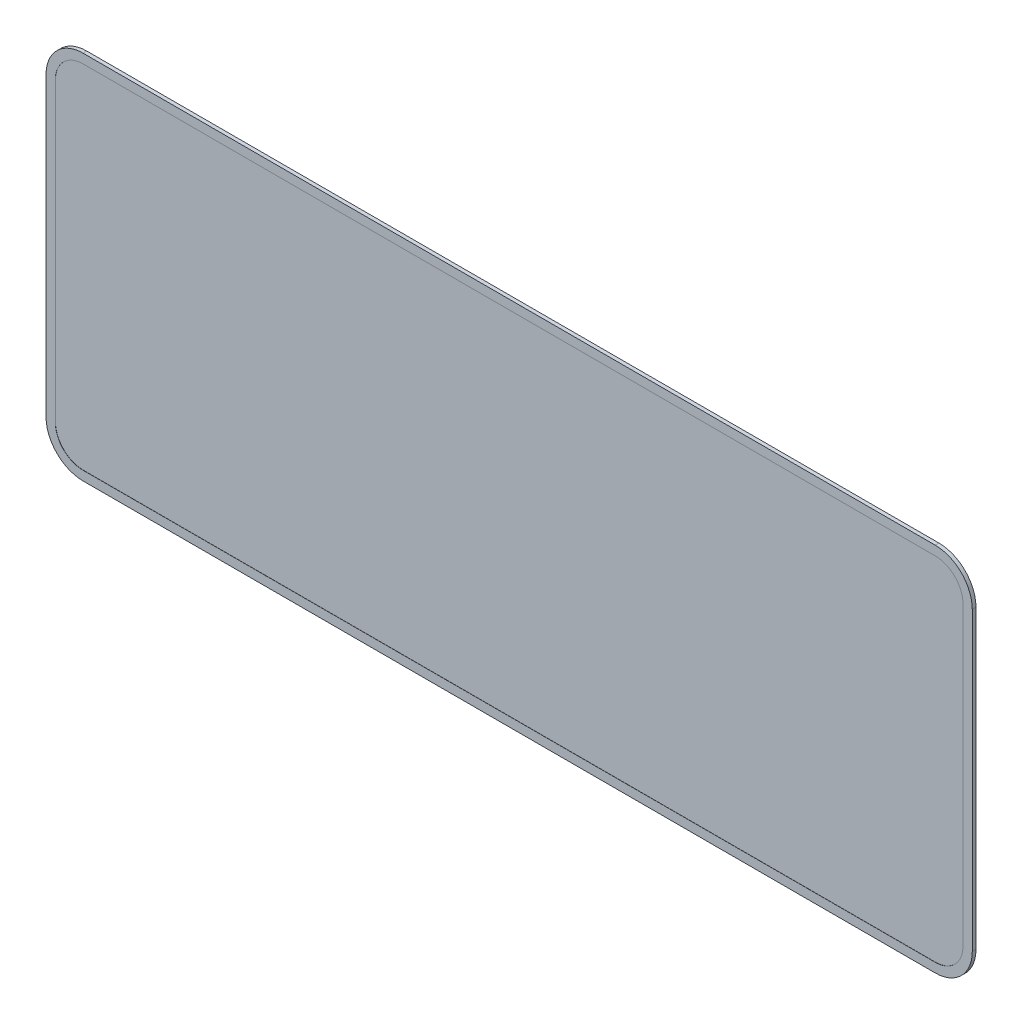
ISO-10303-21;
HEADER;
FILE_DESCRIPTION(('STEP AP214'),'2;1');
FILE_NAME('part.step','',(''),(''),'','','');
FILE_SCHEMA(('AUTOMOTIVE_DESIGN { 1 0 10303 214 1 1 1 1 }'));
ENDSEC;
DATA;
#1=APPLICATION_CONTEXT('core data for automotive mechanical design processes');
#2=APPLICATION_PROTOCOL_DEFINITION('international standard','automotive_design',2000,#1);
#3=PRODUCT_CONTEXT('',#1,'mechanical');
#4=PRODUCT('Part','Part','',(#3));
#5=PRODUCT_RELATED_PRODUCT_CATEGORY('part','',(#4));
#6=PRODUCT_DEFINITION_FORMATION('','',#4);
#7=PRODUCT_DEFINITION_CONTEXT('part definition',#1,'design');
#8=PRODUCT_DEFINITION('design','',#6,#7);
#9=PRODUCT_DEFINITION_SHAPE('','',#8);
#10=(LENGTH_UNIT() NAMED_UNIT(*) SI_UNIT(.MILLI.,.METRE.));
#11=(NAMED_UNIT(*) PLANE_ANGLE_UNIT() SI_UNIT($,.RADIAN.));
#12=(NAMED_UNIT(*) SI_UNIT($,.STERADIAN.) SOLID_ANGLE_UNIT());
#13=UNCERTAINTY_MEASURE_WITH_UNIT(LENGTH_MEASURE(1.E-05),#10,'distance_accuracy_value','');
#14=(GEOMETRIC_REPRESENTATION_CONTEXT(3) GLOBAL_UNCERTAINTY_ASSIGNED_CONTEXT((#13)) GLOBAL_UNIT_ASSIGNED_CONTEXT((#10,
#11,#12)) REPRESENTATION_CONTEXT('',''));
#15=CARTESIAN_POINT('',(0.,0.,0.));
#16=DIRECTION('',(0.,0.,1.));
#17=DIRECTION('',(1.,0.,0.));
#18=AXIS2_PLACEMENT_3D('',#15,#16,#17);
#19=CARTESIAN_POINT('',(480.,20.,2.));
#20=DIRECTION('',(0.,0.,-1.));
#21=DIRECTION('',(-1.,0.,0.));
#22=AXIS2_PLACEMENT_3D('',#19,#20,#21);
#23=CYLINDRICAL_SURFACE('',#22,20.);
#24=CARTESIAN_POINT('',(480.,20.,0.));
#25=DIRECTION('',(0.,0.,1.));
#26=DIRECTION('',(1.,0.,0.));
#27=AXIS2_PLACEMENT_3D('',#24,#25,#26);
#28=CIRCLE('',#27,20.);
#29=CARTESIAN_POINT('',(480.,0.,0.));
#30=VERTEX_POINT('',#29);
#31=CARTESIAN_POINT('',(500.,20.0000000000001,0.));
#32=VERTEX_POINT('',#31);
#33=EDGE_CURVE('E143',#30,#32,#28,.T.);
#34=ORIENTED_EDGE('',*,*,#33,.T.);
#35=DIRECTION('',(0.,0.,-1.));
#36=VECTOR('',#35,1.);
#37=CARTESIAN_POINT('',(500.,20.0000000000001,2.));
#38=LINE('',#37,#36);
#39=CARTESIAN_POINT('',(500.,20.0000000000001,2.));
#40=VERTEX_POINT('',#39);
#41=EDGE_CURVE('E11',#40,#32,#38,.T.);
#42=ORIENTED_EDGE('',*,*,#41,.F.);
#43=CARTESIAN_POINT('',(480.,20.,2.));
#44=DIRECTION('',(0.,0.,1.));
#45=DIRECTION('',(1.,0.,0.));
#46=AXIS2_PLACEMENT_3D('',#43,#44,#45);
#47=CIRCLE('',#46,20.);
#48=CARTESIAN_POINT('',(480.,0.,2.));
#49=VERTEX_POINT('',#48);
#50=EDGE_CURVE('E159',#49,#40,#47,.T.);
#51=ORIENTED_EDGE('',*,*,#50,.F.);
#52=DIRECTION('',(0.,0.,-1.));
#53=VECTOR('',#52,1.);
#54=CARTESIAN_POINT('',(480.,0.,2.));
#55=LINE('',#54,#53);
#56=EDGE_CURVE('E139',#49,#30,#55,.T.);
#57=ORIENTED_EDGE('',*,*,#56,.T.);
#58=EDGE_LOOP('',(#34,#42,#51,#57));
#59=FACE_BOUND('',#58,.T.);
#60=ADVANCED_FACE('F35',(#59),#23,.T.);
#61=CARTESIAN_POINT('',(500.,20.0000000000001,2.));
#62=DIRECTION('',(-1.,0.,0.));
#63=DIRECTION('',(0.,0.,1.));
#64=AXIS2_PLACEMENT_3D('',#61,#62,#63);
#65=PLANE('',#64);
#66=DIRECTION('',(0.,1.,0.));
#67=VECTOR('',#66,1.);
#68=CARTESIAN_POINT('',(500.,20.0000000000001,0.));
#69=LINE('',#68,#67);
#70=CARTESIAN_POINT('',(500.,180.,0.));
#71=VERTEX_POINT('',#70);
#72=EDGE_CURVE('E146',#32,#71,#69,.T.);
#73=ORIENTED_EDGE('',*,*,#72,.T.);
#74=DIRECTION('',(0.,0.,-1.));
#75=VECTOR('',#74,1.);
#76=CARTESIAN_POINT('',(500.,180.,2.));
#77=LINE('',#76,#75);
#78=CARTESIAN_POINT('',(500.,180.,2.));
#79=VERTEX_POINT('',#78);
#80=EDGE_CURVE('E42',#79,#71,#77,.T.);
#81=ORIENTED_EDGE('',*,*,#80,.F.);
#82=DIRECTION('',(0.,1.,0.));
#83=VECTOR('',#82,1.);
#84=CARTESIAN_POINT('',(500.,20.0000000000001,2.));
#85=LINE('',#84,#83);
#86=EDGE_CURVE('E99',#40,#79,#85,.T.);
#87=ORIENTED_EDGE('',*,*,#86,.F.);
#88=ORIENTED_EDGE('',*,*,#41,.T.);
#89=EDGE_LOOP('',(#73,#81,#87,#88));
#90=FACE_BOUND('',#89,.T.);
#91=ADVANCED_FACE('F333',(#90),#65,.F.);
#92=CARTESIAN_POINT('',(480.,180.,2.));
#93=DIRECTION('',(0.,0.,-1.));
#94=DIRECTION('',(-1.,0.,0.));
#95=AXIS2_PLACEMENT_3D('',#92,#93,#94);
#96=CYLINDRICAL_SURFACE('',#95,20.);
#97=CARTESIAN_POINT('',(480.,180.,0.));
#98=DIRECTION('',(0.,0.,1.));
#99=DIRECTION('',(-1.,0.,0.));
#100=AXIS2_PLACEMENT_3D('',#97,#98,#99);
#101=CIRCLE('',#100,20.);
#102=CARTESIAN_POINT('',(480.,200.,0.));
#103=VERTEX_POINT('',#102);
#104=EDGE_CURVE('E149',#71,#103,#101,.T.);
#105=ORIENTED_EDGE('',*,*,#104,.T.);
#106=DIRECTION('',(0.,0.,-1.));
#107=VECTOR('',#106,1.);
#108=CARTESIAN_POINT('',(480.,200.,2.));
#109=LINE('',#108,#107);
#110=CARTESIAN_POINT('',(480.,200.,2.));
#111=VERTEX_POINT('',#110);
#112=EDGE_CURVE('E166',#111,#103,#109,.T.);
#113=ORIENTED_EDGE('',*,*,#112,.F.);
#114=CARTESIAN_POINT('',(480.,180.,2.));
#115=DIRECTION('',(0.,0.,1.));
#116=DIRECTION('',(-1.,0.,0.));
#117=AXIS2_PLACEMENT_3D('',#114,#115,#116);
#118=CIRCLE('',#117,20.);
#119=EDGE_CURVE('E174',#79,#111,#118,.T.);
#120=ORIENTED_EDGE('',*,*,#119,.F.);
#121=ORIENTED_EDGE('',*,*,#80,.T.);
#122=EDGE_LOOP('',(#105,#113,#120,#121));
#123=FACE_BOUND('',#122,.T.);
#124=ADVANCED_FACE('F172',(#123),#96,.T.);
#125=CARTESIAN_POINT('',(20.0000000000001,200.,2.));
#126=DIRECTION('',(0.,-1.,0.));
#127=DIRECTION('',(0.,0.,-1.));
#128=AXIS2_PLACEMENT_3D('',#125,#126,#127);
#129=PLANE('',#128);
#130=DIRECTION('',(-1.,0.,0.));
#131=VECTOR('',#130,1.);
#132=CARTESIAN_POINT('',(20.0000000000001,200.,0.));
#133=LINE('',#132,#131);
#134=CARTESIAN_POINT('',(20.0000000000001,200.,0.));
#135=VERTEX_POINT('',#134);
#136=EDGE_CURVE('E151',#103,#135,#133,.T.);
#137=ORIENTED_EDGE('',*,*,#136,.T.);
#138=DIRECTION('',(0.,0.,-1.));
#139=VECTOR('',#138,1.);
#140=CARTESIAN_POINT('',(20.0000000000001,200.,2.));
#141=LINE('',#140,#139);
#142=CARTESIAN_POINT('',(20.0000000000001,200.,2.));
#143=VERTEX_POINT('',#142);
#144=EDGE_CURVE('E163',#143,#135,#141,.T.);
#145=ORIENTED_EDGE('',*,*,#144,.F.);
#146=DIRECTION('',(-1.,0.,0.));
#147=VECTOR('',#146,1.);
#148=CARTESIAN_POINT('',(20.0000000000001,200.,2.));
#149=LINE('',#148,#147);
#150=EDGE_CURVE('E186',#111,#143,#149,.T.);
#151=ORIENTED_EDGE('',*,*,#150,.F.);
#152=ORIENTED_EDGE('',*,*,#112,.T.);
#153=EDGE_LOOP('',(#137,#145,#151,#152));
#154=FACE_BOUND('',#153,.T.);
#155=ADVANCED_FACE('F182',(#154),#129,.F.);
#156=CARTESIAN_POINT('',(20.,180.,2.));
#157=DIRECTION('',(0.,0.,-1.));
#158=DIRECTION('',(-1.,0.,0.));
#159=AXIS2_PLACEMENT_3D('',#156,#157,#158);
#160=CYLINDRICAL_SURFACE('',#159,20.);
#161=CARTESIAN_POINT('',(20.,180.,0.));
#162=DIRECTION('',(0.,0.,1.));
#163=DIRECTION('',(-1.,0.,0.));
#164=AXIS2_PLACEMENT_3D('',#161,#162,#163);
#165=CIRCLE('',#164,20.);
#166=CARTESIAN_POINT('',(0.,180.,0.));
#167=VERTEX_POINT('',#166);
#168=EDGE_CURVE('E153',#135,#167,#165,.T.);
#169=ORIENTED_EDGE('',*,*,#168,.T.);
#170=DIRECTION('',(0.,0.,-1.));
#171=VECTOR('',#170,1.);
#172=CARTESIAN_POINT('',(0.,180.,2.));
#173=LINE('',#172,#171);
#174=CARTESIAN_POINT('',(0.,180.,2.));
#175=VERTEX_POINT('',#174);
#176=EDGE_CURVE('E134',#175,#167,#173,.T.);
#177=ORIENTED_EDGE('',*,*,#176,.F.);
#178=CARTESIAN_POINT('',(20.,180.,2.));
#179=DIRECTION('',(0.,0.,1.));
#180=DIRECTION('',(-1.,0.,0.));
#181=AXIS2_PLACEMENT_3D('',#178,#179,#180);
#182=CIRCLE('',#181,20.);
#183=EDGE_CURVE('E122',#143,#175,#182,.T.);
#184=ORIENTED_EDGE('',*,*,#183,.F.);
#185=ORIENTED_EDGE('',*,*,#144,.T.);
#186=EDGE_LOOP('',(#169,#177,#184,#185));
#187=FACE_BOUND('',#186,.T.);
#188=ADVANCED_FACE('F185',(#187),#160,.T.);
#189=CARTESIAN_POINT('',(0.,20.0000000000001,2.));
#190=DIRECTION('',(1.,0.,0.));
#191=DIRECTION('',(0.,0.,-1.));
#192=AXIS2_PLACEMENT_3D('',#189,#190,#191);
#193=PLANE('',#192);
#194=DIRECTION('',(0.,-1.,0.));
#195=VECTOR('',#194,1.);
#196=CARTESIAN_POINT('',(0.,20.0000000000001,0.));
#197=LINE('',#196,#195);
#198=CARTESIAN_POINT('',(0.,20.,0.));
#199=VERTEX_POINT('',#198);
#200=EDGE_CURVE('E131',#167,#199,#197,.T.);
#201=ORIENTED_EDGE('',*,*,#200,.T.);
#202=DIRECTION('',(0.,0.,-1.));
#203=VECTOR('',#202,1.);
#204=CARTESIAN_POINT('',(0.,20.,2.));
#205=LINE('',#204,#203);
#206=CARTESIAN_POINT('',(0.,20.,2.));
#207=VERTEX_POINT('',#206);
#208=EDGE_CURVE('E128',#207,#199,#205,.T.);
#209=ORIENTED_EDGE('',*,*,#208,.F.);
#210=DIRECTION('',(0.,-1.,0.));
#211=VECTOR('',#210,1.);
#212=CARTESIAN_POINT('',(0.,20.0000000000001,2.));
#213=LINE('',#212,#211);
#214=EDGE_CURVE('E115',#175,#207,#213,.T.);
#215=ORIENTED_EDGE('',*,*,#214,.F.);
#216=ORIENTED_EDGE('',*,*,#176,.T.);
#217=EDGE_LOOP('',(#201,#209,#215,#216));
#218=FACE_BOUND('',#217,.T.);
#219=ADVANCED_FACE('F129',(#218),#193,.F.);
#220=CARTESIAN_POINT('',(20.,20.,2.));
#221=DIRECTION('',(0.,0.,-1.));
#222=DIRECTION('',(-1.,0.,0.));
#223=AXIS2_PLACEMENT_3D('',#220,#221,#222);
#224=CYLINDRICAL_SURFACE('',#223,20.);
#225=CARTESIAN_POINT('',(20.,20.,0.));
#226=DIRECTION('',(0.,0.,1.));
#227=DIRECTION('',(-1.,0.,0.));
#228=AXIS2_PLACEMENT_3D('',#225,#226,#227);
#229=CIRCLE('',#228,20.);
#230=CARTESIAN_POINT('',(20.0000000000001,0.,0.));
#231=VERTEX_POINT('',#230);
#232=EDGE_CURVE('E156',#199,#231,#229,.T.);
#233=ORIENTED_EDGE('',*,*,#232,.T.);
#234=DIRECTION('',(0.,0.,-1.));
#235=VECTOR('',#234,1.);
#236=CARTESIAN_POINT('',(20.0000000000001,0.,2.));
#237=LINE('',#236,#235);
#238=CARTESIAN_POINT('',(20.0000000000001,0.,2.));
#239=VERTEX_POINT('',#238);
#240=EDGE_CURVE('E135',#239,#231,#237,.T.);
#241=ORIENTED_EDGE('',*,*,#240,.F.);
#242=CARTESIAN_POINT('',(20.,20.,2.));
#243=DIRECTION('',(0.,0.,1.));
#244=DIRECTION('',(-1.,0.,0.));
#245=AXIS2_PLACEMENT_3D('',#242,#243,#244);
#246=CIRCLE('',#245,20.);
#247=EDGE_CURVE('E119',#207,#239,#246,.T.);
#248=ORIENTED_EDGE('',*,*,#247,.F.);
#249=ORIENTED_EDGE('',*,*,#208,.T.);
#250=EDGE_LOOP('',(#233,#241,#248,#249));
#251=FACE_BOUND('',#250,.T.);
#252=ADVANCED_FACE('F137',(#251),#224,.T.);
#253=CARTESIAN_POINT('',(20.0000000000001,0.,2.));
#254=DIRECTION('',(0.,1.,0.));
#255=DIRECTION('',(0.,0.,1.));
#256=AXIS2_PLACEMENT_3D('',#253,#254,#255);
#257=PLANE('',#256);
#258=DIRECTION('',(1.,0.,0.));
#259=VECTOR('',#258,1.);
#260=CARTESIAN_POINT('',(20.0000000000001,0.,0.));
#261=LINE('',#260,#259);
#262=EDGE_CURVE('E91',#231,#30,#261,.T.);
#263=ORIENTED_EDGE('',*,*,#262,.T.);
#264=ORIENTED_EDGE('',*,*,#56,.F.);
#265=DIRECTION('',(1.,0.,0.));
#266=VECTOR('',#265,1.);
#267=CARTESIAN_POINT('',(20.0000000000001,0.,2.));
#268=LINE('',#267,#266);
#269=EDGE_CURVE('E58',#239,#49,#268,.T.);
#270=ORIENTED_EDGE('',*,*,#269,.F.);
#271=ORIENTED_EDGE('',*,*,#240,.T.);
#272=EDGE_LOOP('',(#263,#264,#270,#271));
#273=FACE_BOUND('',#272,.T.);
#274=ADVANCED_FACE('F340',(#273),#257,.F.);
#275=CARTESIAN_POINT('',(480.,20.,2.));
#276=DIRECTION('',(0.,0.,1.));
#277=DIRECTION('',(1.,0.,0.));
#278=AXIS2_PLACEMENT_3D('',#275,#276,#277);
#279=PLANE('',#278);
#280=CARTESIAN_POINT('',(480.,20.,2.));
#281=DIRECTION('',(0.,0.,1.));
#282=DIRECTION('',(1.,0.,0.));
#283=AXIS2_PLACEMENT_3D('',#280,#281,#282);
#284=CIRCLE('',#283,15.);
#285=CARTESIAN_POINT('',(480.,4.99999999999999,2.));
#286=VERTEX_POINT('',#285);
#287=CARTESIAN_POINT('',(495.,20.,2.));
#288=VERTEX_POINT('',#287);
#289=EDGE_CURVE('E49',#286,#288,#284,.T.);
#290=ORIENTED_EDGE('',*,*,#289,.F.);
#291=DIRECTION('',(1.,0.,0.));
#292=VECTOR('',#291,1.);
#293=CARTESIAN_POINT('',(20.0000000000001,5.,2.));
#294=LINE('',#293,#292);
#295=CARTESIAN_POINT('',(20.0000000000001,5.,2.));
#296=VERTEX_POINT('',#295);
#297=EDGE_CURVE('E214',#296,#286,#294,.T.);
#298=ORIENTED_EDGE('',*,*,#297,.F.);
#299=CARTESIAN_POINT('',(20.,20.,2.));
#300=DIRECTION('',(0.,0.,1.));
#301=DIRECTION('',(1.,0.,0.));
#302=AXIS2_PLACEMENT_3D('',#299,#300,#301);
#303=CIRCLE('',#302,15.);
#304=CARTESIAN_POINT('',(5.,20.,2.));
#305=VERTEX_POINT('',#304);
#306=EDGE_CURVE('E218',#305,#296,#303,.T.);
#307=ORIENTED_EDGE('',*,*,#306,.F.);
#308=DIRECTION('',(0.,-1.,0.));
#309=VECTOR('',#308,1.);
#310=CARTESIAN_POINT('',(5.,180.,2.));
#311=LINE('',#310,#309);
#312=CARTESIAN_POINT('',(5.,180.,2.));
#313=VERTEX_POINT('',#312);
#314=EDGE_CURVE('E221',#313,#305,#311,.T.);
#315=ORIENTED_EDGE('',*,*,#314,.F.);
#316=CARTESIAN_POINT('',(20.,180.,2.));
#317=DIRECTION('',(0.,0.,1.));
#318=DIRECTION('',(1.,0.,0.));
#319=AXIS2_PLACEMENT_3D('',#316,#317,#318);
#320=CIRCLE('',#319,15.);
#321=CARTESIAN_POINT('',(20.0000000000001,195.,2.));
#322=VERTEX_POINT('',#321);
#323=EDGE_CURVE('E224',#322,#313,#320,.T.);
#324=ORIENTED_EDGE('',*,*,#323,.F.);
#325=DIRECTION('',(-1.,0.,0.));
#326=VECTOR('',#325,1.);
#327=CARTESIAN_POINT('',(480.,195.,2.));
#328=LINE('',#327,#326);
#329=CARTESIAN_POINT('',(480.,195.,2.));
#330=VERTEX_POINT('',#329);
#331=EDGE_CURVE('E227',#330,#322,#328,.T.);
#332=ORIENTED_EDGE('',*,*,#331,.F.);
#333=CARTESIAN_POINT('',(480.,180.,2.));
#334=DIRECTION('',(0.,0.,1.));
#335=DIRECTION('',(1.,0.,0.));
#336=AXIS2_PLACEMENT_3D('',#333,#334,#335);
#337=CIRCLE('',#336,15.);
#338=CARTESIAN_POINT('',(495.,180.,2.));
#339=VERTEX_POINT('',#338);
#340=EDGE_CURVE('E230',#339,#330,#337,.T.);
#341=ORIENTED_EDGE('',*,*,#340,.F.);
#342=DIRECTION('',(0.,1.,0.));
#343=VECTOR('',#342,1.);
#344=CARTESIAN_POINT('',(495.,20.,2.));
#345=LINE('',#344,#343);
#346=EDGE_CURVE('E233',#288,#339,#345,.T.);
#347=ORIENTED_EDGE('',*,*,#346,.F.);
#348=EDGE_LOOP('',(#290,#298,#307,#315,#324,#332,#341,#347));
#349=FACE_BOUND('',#348,.T.);
#350=ORIENTED_EDGE('',*,*,#50,.T.);
#351=ORIENTED_EDGE('',*,*,#86,.T.);
#352=ORIENTED_EDGE('',*,*,#119,.T.);
#353=ORIENTED_EDGE('',*,*,#150,.T.);
#354=ORIENTED_EDGE('',*,*,#183,.T.);
#355=ORIENTED_EDGE('',*,*,#214,.T.);
#356=ORIENTED_EDGE('',*,*,#247,.T.);
#357=ORIENTED_EDGE('',*,*,#269,.T.);
#358=EDGE_LOOP('',(#350,#351,#352,#353,#354,#355,#356,#357));
#359=FACE_BOUND('',#358,.T.);
#360=ADVANCED_FACE('F117',(#349,#359),#279,.T.);
#361=CARTESIAN_POINT('',(480.,20.,0.));
#362=DIRECTION('',(0.,0.,1.));
#363=DIRECTION('',(1.,0.,0.));
#364=AXIS2_PLACEMENT_3D('',#361,#362,#363);
#365=PLANE('',#364);
#366=ORIENTED_EDGE('',*,*,#33,.F.);
#367=ORIENTED_EDGE('',*,*,#262,.F.);
#368=ORIENTED_EDGE('',*,*,#232,.F.);
#369=ORIENTED_EDGE('',*,*,#200,.F.);
#370=ORIENTED_EDGE('',*,*,#168,.F.);
#371=ORIENTED_EDGE('',*,*,#136,.F.);
#372=ORIENTED_EDGE('',*,*,#104,.F.);
#373=ORIENTED_EDGE('',*,*,#72,.F.);
#374=EDGE_LOOP('',(#366,#367,#368,#369,#370,#371,#372,#373));
#375=FACE_BOUND('',#374,.T.);
#376=ADVANCED_FACE('F178',(#375),#365,.F.);
#377=CARTESIAN_POINT('',(480.,20.,1.9));
#378=DIRECTION('',(0.,0.,1.));
#379=DIRECTION('',(1.,0.,0.));
#380=AXIS2_PLACEMENT_3D('',#377,#378,#379);
#381=CYLINDRICAL_SURFACE('',#380,15.);
#382=ORIENTED_EDGE('',*,*,#289,.T.);
#383=DIRECTION('',(0.,0.,1.));
#384=VECTOR('',#383,1.);
#385=CARTESIAN_POINT('',(495.,20.,1.9));
#386=LINE('',#385,#384);
#387=CARTESIAN_POINT('',(495.,20.,1.9));
#388=VERTEX_POINT('',#387);
#389=EDGE_CURVE('E192',#388,#288,#386,.T.);
#390=ORIENTED_EDGE('',*,*,#389,.F.);
#391=CARTESIAN_POINT('',(480.,20.,1.9));
#392=DIRECTION('',(0.,0.,1.));
#393=DIRECTION('',(1.,0.,0.));
#394=AXIS2_PLACEMENT_3D('',#391,#392,#393);
#395=CIRCLE('',#394,15.);
#396=CARTESIAN_POINT('',(480.,4.99999999999999,1.9));
#397=VERTEX_POINT('',#396);
#398=EDGE_CURVE('E217',#397,#388,#395,.T.);
#399=ORIENTED_EDGE('',*,*,#398,.F.);
#400=DIRECTION('',(0.,0.,1.));
#401=VECTOR('',#400,1.);
#402=CARTESIAN_POINT('',(480.,4.99999999999999,1.9));
#403=LINE('',#402,#401);
#404=EDGE_CURVE('E147',#397,#286,#403,.T.);
#405=ORIENTED_EDGE('',*,*,#404,.T.);
#406=EDGE_LOOP('',(#382,#390,#399,#405));
#407=FACE_BOUND('',#406,.T.);
#408=ADVANCED_FACE('F266',(#407),#381,.F.);
#409=CARTESIAN_POINT('',(20.0000000000001,5.,1.9));
#410=DIRECTION('',(0.,-1.,0.));
#411=DIRECTION('',(1.,0.,0.));
#412=AXIS2_PLACEMENT_3D('',#409,#410,#411);
#413=PLANE('',#412);
#414=ORIENTED_EDGE('',*,*,#297,.T.);
#415=ORIENTED_EDGE('',*,*,#404,.F.);
#416=DIRECTION('',(1.,0.,0.));
#417=VECTOR('',#416,1.);
#418=CARTESIAN_POINT('',(20.0000000000001,5.,1.9));
#419=LINE('',#418,#417);
#420=CARTESIAN_POINT('',(20.0000000000001,5.,1.9));
#421=VERTEX_POINT('',#420);
#422=EDGE_CURVE('E195',#421,#397,#419,.T.);
#423=ORIENTED_EDGE('',*,*,#422,.F.);
#424=DIRECTION('',(0.,0.,1.));
#425=VECTOR('',#424,1.);
#426=CARTESIAN_POINT('',(20.0000000000001,5.,1.9));
#427=LINE('',#426,#425);
#428=EDGE_CURVE('E210',#421,#296,#427,.T.);
#429=ORIENTED_EDGE('',*,*,#428,.T.);
#430=EDGE_LOOP('',(#414,#415,#423,#429));
#431=FACE_BOUND('',#430,.T.);
#432=ADVANCED_FACE('F286',(#431),#413,.F.);
#433=CARTESIAN_POINT('',(20.,20.,1.9));
#434=DIRECTION('',(0.,0.,1.));
#435=DIRECTION('',(1.,0.,0.));
#436=AXIS2_PLACEMENT_3D('',#433,#434,#435);
#437=CYLINDRICAL_SURFACE('',#436,15.);
#438=ORIENTED_EDGE('',*,*,#306,.T.);
#439=ORIENTED_EDGE('',*,*,#428,.F.);
#440=CARTESIAN_POINT('',(20.,20.,1.9));
#441=DIRECTION('',(0.,0.,1.));
#442=DIRECTION('',(1.,0.,0.));
#443=AXIS2_PLACEMENT_3D('',#440,#441,#442);
#444=CIRCLE('',#443,15.);
#445=CARTESIAN_POINT('',(5.,20.,1.9));
#446=VERTEX_POINT('',#445);
#447=EDGE_CURVE('E239',#446,#421,#444,.T.);
#448=ORIENTED_EDGE('',*,*,#447,.F.);
#449=DIRECTION('',(0.,0.,1.));
#450=VECTOR('',#449,1.);
#451=CARTESIAN_POINT('',(5.,20.,1.9));
#452=LINE('',#451,#450);
#453=EDGE_CURVE('E207',#446,#305,#452,.T.);
#454=ORIENTED_EDGE('',*,*,#453,.T.);
#455=EDGE_LOOP('',(#438,#439,#448,#454));
#456=FACE_BOUND('',#455,.T.);
#457=ADVANCED_FACE('F291',(#456),#437,.F.);
#458=CARTESIAN_POINT('',(5.,180.,1.9));
#459=DIRECTION('',(-1.,0.,0.));
#460=DIRECTION('',(0.,-1.,0.));
#461=AXIS2_PLACEMENT_3D('',#458,#459,#460);
#462=PLANE('',#461);
#463=ORIENTED_EDGE('',*,*,#314,.T.);
#464=ORIENTED_EDGE('',*,*,#453,.F.);
#465=DIRECTION('',(0.,-1.,0.));
#466=VECTOR('',#465,1.);
#467=CARTESIAN_POINT('',(5.,180.,1.9));
#468=LINE('',#467,#466);
#469=CARTESIAN_POINT('',(5.,180.,1.9));
#470=VERTEX_POINT('',#469);
#471=EDGE_CURVE('E242',#470,#446,#468,.T.);
#472=ORIENTED_EDGE('',*,*,#471,.F.);
#473=DIRECTION('',(0.,0.,1.));
#474=VECTOR('',#473,1.);
#475=CARTESIAN_POINT('',(5.,180.,1.9));
#476=LINE('',#475,#474);
#477=EDGE_CURVE('E204',#470,#313,#476,.T.);
#478=ORIENTED_EDGE('',*,*,#477,.T.);
#479=EDGE_LOOP('',(#463,#464,#472,#478));
#480=FACE_BOUND('',#479,.T.);
#481=ADVANCED_FACE('F317',(#480),#462,.F.);
#482=CARTESIAN_POINT('',(20.,180.,1.9));
#483=DIRECTION('',(0.,0.,1.));
#484=DIRECTION('',(1.,0.,0.));
#485=AXIS2_PLACEMENT_3D('',#482,#483,#484);
#486=CYLINDRICAL_SURFACE('',#485,15.);
#487=ORIENTED_EDGE('',*,*,#323,.T.);
#488=ORIENTED_EDGE('',*,*,#477,.F.);
#489=CARTESIAN_POINT('',(20.,180.,1.9));
#490=DIRECTION('',(0.,0.,1.));
#491=DIRECTION('',(1.,0.,0.));
#492=AXIS2_PLACEMENT_3D('',#489,#490,#491);
#493=CIRCLE('',#492,15.);
#494=CARTESIAN_POINT('',(20.0000000000001,195.,1.9));
#495=VERTEX_POINT('',#494);
#496=EDGE_CURVE('E245',#495,#470,#493,.T.);
#497=ORIENTED_EDGE('',*,*,#496,.F.);
#498=DIRECTION('',(0.,0.,1.));
#499=VECTOR('',#498,1.);
#500=CARTESIAN_POINT('',(20.0000000000001,195.,1.9));
#501=LINE('',#500,#499);
#502=EDGE_CURVE('E201',#495,#322,#501,.T.);
#503=ORIENTED_EDGE('',*,*,#502,.T.);
#504=EDGE_LOOP('',(#487,#488,#497,#503));
#505=FACE_BOUND('',#504,.T.);
#506=ADVANCED_FACE('F320',(#505),#486,.F.);
#507=CARTESIAN_POINT('',(480.,195.,1.9));
#508=DIRECTION('',(0.,1.,0.));
#509=DIRECTION('',(-1.,0.,0.));
#510=AXIS2_PLACEMENT_3D('',#507,#508,#509);
#511=PLANE('',#510);
#512=ORIENTED_EDGE('',*,*,#331,.T.);
#513=ORIENTED_EDGE('',*,*,#502,.F.);
#514=DIRECTION('',(-1.,0.,0.));
#515=VECTOR('',#514,1.);
#516=CARTESIAN_POINT('',(480.,195.,1.9));
#517=LINE('',#516,#515);
#518=CARTESIAN_POINT('',(480.,195.,1.9));
#519=VERTEX_POINT('',#518);
#520=EDGE_CURVE('E248',#519,#495,#517,.T.);
#521=ORIENTED_EDGE('',*,*,#520,.F.);
#522=DIRECTION('',(0.,0.,1.));
#523=VECTOR('',#522,1.);
#524=CARTESIAN_POINT('',(480.,195.,1.9));
#525=LINE('',#524,#523);
#526=EDGE_CURVE('E198',#519,#330,#525,.T.);
#527=ORIENTED_EDGE('',*,*,#526,.T.);
#528=EDGE_LOOP('',(#512,#513,#521,#527));
#529=FACE_BOUND('',#528,.T.);
#530=ADVANCED_FACE('F323',(#529),#511,.F.);
#531=CARTESIAN_POINT('',(480.,180.,1.9));
#532=DIRECTION('',(0.,0.,1.));
#533=DIRECTION('',(1.,0.,0.));
#534=AXIS2_PLACEMENT_3D('',#531,#532,#533);
#535=CYLINDRICAL_SURFACE('',#534,15.);
#536=ORIENTED_EDGE('',*,*,#340,.T.);
#537=ORIENTED_EDGE('',*,*,#526,.F.);
#538=CARTESIAN_POINT('',(480.,180.,1.9));
#539=DIRECTION('',(0.,0.,1.));
#540=DIRECTION('',(1.,0.,0.));
#541=AXIS2_PLACEMENT_3D('',#538,#539,#540);
#542=CIRCLE('',#541,15.);
#543=CARTESIAN_POINT('',(495.,180.,1.9));
#544=VERTEX_POINT('',#543);
#545=EDGE_CURVE('E251',#544,#519,#542,.T.);
#546=ORIENTED_EDGE('',*,*,#545,.F.);
#547=DIRECTION('',(0.,0.,1.));
#548=VECTOR('',#547,1.);
#549=CARTESIAN_POINT('',(495.,180.,1.9));
#550=LINE('',#549,#548);
#551=EDGE_CURVE('E194',#544,#339,#550,.T.);
#552=ORIENTED_EDGE('',*,*,#551,.T.);
#553=EDGE_LOOP('',(#536,#537,#546,#552));
#554=FACE_BOUND('',#553,.T.);
#555=ADVANCED_FACE('F306',(#554),#535,.F.);
#556=CARTESIAN_POINT('',(495.,20.,1.9));
#557=DIRECTION('',(1.,0.,0.));
#558=DIRECTION('',(0.,0.,-1.));
#559=AXIS2_PLACEMENT_3D('',#556,#557,#558);
#560=PLANE('',#559);
#561=ORIENTED_EDGE('',*,*,#346,.T.);
#562=ORIENTED_EDGE('',*,*,#551,.F.);
#563=DIRECTION('',(0.,1.,0.));
#564=VECTOR('',#563,1.);
#565=CARTESIAN_POINT('',(495.,20.,1.9));
#566=LINE('',#565,#564);
#567=EDGE_CURVE('E254',#388,#544,#566,.T.);
#568=ORIENTED_EDGE('',*,*,#567,.F.);
#569=ORIENTED_EDGE('',*,*,#389,.T.);
#570=EDGE_LOOP('',(#561,#562,#568,#569));
#571=FACE_BOUND('',#570,.T.);
#572=ADVANCED_FACE('F300',(#571),#560,.F.);
#573=CARTESIAN_POINT('',(480.,20.,1.9));
#574=DIRECTION('',(0.,0.,1.));
#575=DIRECTION('',(1.,0.,0.));
#576=AXIS2_PLACEMENT_3D('',#573,#574,#575);
#577=PLANE('',#576);
#578=ORIENTED_EDGE('',*,*,#398,.T.);
#579=ORIENTED_EDGE('',*,*,#567,.T.);
#580=ORIENTED_EDGE('',*,*,#545,.T.);
#581=ORIENTED_EDGE('',*,*,#520,.T.);
#582=ORIENTED_EDGE('',*,*,#496,.T.);
#583=ORIENTED_EDGE('',*,*,#471,.T.);
#584=ORIENTED_EDGE('',*,*,#447,.T.);
#585=ORIENTED_EDGE('',*,*,#422,.T.);
#586=EDGE_LOOP('',(#578,#579,#580,#581,#582,#583,#584,#585));
#587=FACE_BOUND('',#586,.T.);
#588=ADVANCED_FACE('F261',(#587),#577,.T.);
#589=CLOSED_SHELL('',(#60,#91,#124,#155,#188,#219,#252,#274,#360,#376,#408,#432,#457,#481,#506,
#530,#555,#572,#588));
#590=MANIFOLD_SOLID_BREP('B2',#589);
#591=ADVANCED_BREP_SHAPE_REPRESENTATION('',(#18,#590),#14);
#592=SHAPE_DEFINITION_REPRESENTATION(#9,#591);
ENDSEC;
END-ISO-10303-21;
